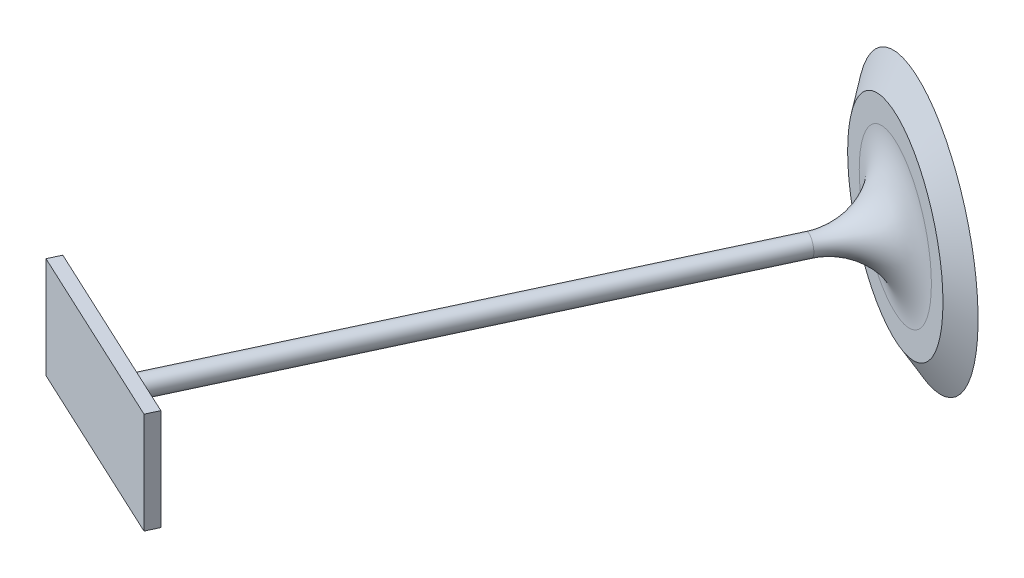
ISO-10303-21;
HEADER;
FILE_DESCRIPTION(('STEP AP214'),'2;1');
FILE_NAME('part.step','',(''),(''),'','','');
FILE_SCHEMA(('AUTOMOTIVE_DESIGN { 1 0 10303 214 1 1 1 1 }'));
ENDSEC;
DATA;
#1=APPLICATION_CONTEXT('core data for automotive mechanical design processes');
#2=APPLICATION_PROTOCOL_DEFINITION('international standard','automotive_design',2000,#1);
#3=PRODUCT_CONTEXT('',#1,'mechanical');
#4=PRODUCT('Part','Part','',(#3));
#5=PRODUCT_RELATED_PRODUCT_CATEGORY('part','',(#4));
#6=PRODUCT_DEFINITION_FORMATION('','',#4);
#7=PRODUCT_DEFINITION_CONTEXT('part definition',#1,'design');
#8=PRODUCT_DEFINITION('design','',#6,#7);
#9=PRODUCT_DEFINITION_SHAPE('','',#8);
#10=(LENGTH_UNIT() NAMED_UNIT(*) SI_UNIT(.MILLI.,.METRE.));
#11=(NAMED_UNIT(*) PLANE_ANGLE_UNIT() SI_UNIT($,.RADIAN.));
#12=(NAMED_UNIT(*) SI_UNIT($,.STERADIAN.) SOLID_ANGLE_UNIT());
#13=UNCERTAINTY_MEASURE_WITH_UNIT(LENGTH_MEASURE(1.E-05),#10,'distance_accuracy_value','');
#14=(GEOMETRIC_REPRESENTATION_CONTEXT(3) GLOBAL_UNCERTAINTY_ASSIGNED_CONTEXT((#13)) GLOBAL_UNIT_ASSIGNED_CONTEXT((#10,
#11,#12)) REPRESENTATION_CONTEXT('',''));
#15=CARTESIAN_POINT('',(0.,0.,0.));
#16=DIRECTION('',(0.,0.,1.));
#17=DIRECTION('',(1.,0.,0.));
#18=AXIS2_PLACEMENT_3D('',#15,#16,#17);
#19=CARTESIAN_POINT('',(-75.7344835628669,74.8033504536804,1.38477922887827));
#20=DIRECTION('',(-0.422618261740669,0.,0.906307787036664));
#21=DIRECTION('',(0.906307787036664,0.,0.422618261740669));
#22=AXIS2_PLACEMENT_3D('',#19,#20,#21);
#23=PLANE('',#22);
#24=DIRECTION('',(0.906307787036665,0.,0.422618261740666));
#25=VECTOR('',#24,1.);
#26=CARTESIAN_POINT('',(-88.299030378186,69.8033504536804,-4.47416517235143));
#27=LINE('',#26,#25);
#28=CARTESIAN_POINT('',(-88.299030378186,69.8033504536803,-4.47416517235143));
#29=VERTEX_POINT('',#28);
#30=CARTESIAN_POINT('',(-70.1728746374526,69.8033504536804,3.97820006246189));
#31=VERTEX_POINT('',#30);
#32=EDGE_CURVE('E80',#29,#31,#27,.T.);
#33=ORIENTED_EDGE('',*,*,#32,.T.);
#34=DIRECTION('',(0.,1.,0.));
#35=VECTOR('',#34,1.);
#36=CARTESIAN_POINT('',(-70.1728746374526,69.8033504536803,3.97820006246189));
#37=LINE('',#36,#35);
#38=CARTESIAN_POINT('',(-70.1728746374526,79.8033504536803,3.97820006246189));
#39=VERTEX_POINT('',#38);
#40=EDGE_CURVE('E79',#39,#31,#37,.F.);
#41=ORIENTED_EDGE('',*,*,#40,.F.);
#42=DIRECTION('',(-0.906307787036666,0.,-0.422618261740666));
#43=VECTOR('',#42,1.);
#44=CARTESIAN_POINT('',(-70.1728746374526,79.8033504536803,3.97820006246189));
#45=LINE('',#44,#43);
#46=CARTESIAN_POINT('',(-88.299030378186,79.8033504536803,-4.47416517235143));
#47=VERTEX_POINT('',#46);
#48=EDGE_CURVE('E66',#39,#47,#45,.T.);
#49=ORIENTED_EDGE('',*,*,#48,.T.);
#50=DIRECTION('',(0.,1.,0.));
#51=VECTOR('',#50,1.);
#52=CARTESIAN_POINT('',(-88.299030378186,79.8033504536803,-4.47416517235143));
#53=LINE('',#52,#51);
#54=EDGE_CURVE('E96',#29,#47,#53,.T.);
#55=ORIENTED_EDGE('',*,*,#54,.F.);
#56=EDGE_LOOP('',(#33,#41,#49,#55));
#57=FACE_BOUND('',#56,.T.);
#58=ADVANCED_FACE('F17',(#57),#23,.T.);
#59=CARTESIAN_POINT('',(-90.5647998457776,79.8033504536803,-5.53071082670309));
#60=DIRECTION('',(0.,-1.,0.));
#61=DIRECTION('',(0.,0.,-1.));
#62=AXIS2_PLACEMENT_3D('',#59,#60,#61);
#63=PLANE('',#62);
#64=DIRECTION('',(0.422618261740668,0.,-0.906307787036665));
#65=VECTOR('',#64,1.);
#66=CARTESIAN_POINT('',(-70.1728746374526,79.8033504536803,3.97820006246189));
#67=LINE('',#66,#65);
#68=CARTESIAN_POINT('',(-69.6446017993875,79.8033504536803,2.8453153053139));
#69=VERTEX_POINT('',#68);
#70=EDGE_CURVE('E70',#69,#39,#67,.F.);
#71=ORIENTED_EDGE('',*,*,#70,.F.);
#72=DIRECTION('',(-0.906307787036664,0.,-0.422618261740669));
#73=VECTOR('',#72,1.);
#74=CARTESIAN_POINT('',(-74.7711829870238,79.8033504536803,0.454751237365959));
#75=LINE('',#74,#73);
#76=CARTESIAN_POINT('',(-87.7707575401208,79.8033504536803,-5.60704992949947));
#77=VERTEX_POINT('',#76);
#78=EDGE_CURVE('E95',#77,#69,#75,.F.);
#79=ORIENTED_EDGE('',*,*,#78,.F.);
#80=DIRECTION('',(-0.422618261740668,0.,0.906307787036665));
#81=VECTOR('',#80,1.);
#82=CARTESIAN_POINT('',(-88.299030378186,79.8033504536803,-4.47416517235143));
#83=LINE('',#82,#81);
#84=EDGE_CURVE('E73',#47,#77,#83,.F.);
#85=ORIENTED_EDGE('',*,*,#84,.F.);
#86=ORIENTED_EDGE('',*,*,#48,.F.);
#87=EDGE_LOOP('',(#71,#79,#85,#86));
#88=FACE_BOUND('',#87,.T.);
#89=ADVANCED_FACE('F68',(#88),#63,.F.);
#90=CARTESIAN_POINT('',(-70.1728746374526,69.8033504536803,3.97820006246189));
#91=DIRECTION('',(0.906307787036665,0.,0.422618261740668));
#92=DIRECTION('',(0.422618261740668,0.,-0.906307787036665));
#93=AXIS2_PLACEMENT_3D('',#90,#91,#92);
#94=PLANE('',#93);
#95=ORIENTED_EDGE('',*,*,#40,.T.);
#96=DIRECTION('',(0.422618261740672,0.,-0.906307787036663));
#97=VECTOR('',#96,1.);
#98=CARTESIAN_POINT('',(-70.1728746374526,69.8033504536804,3.97820006246189));
#99=LINE('',#98,#97);
#100=CARTESIAN_POINT('',(-69.6446017993875,69.8033504536803,2.8453153053139));
#101=VERTEX_POINT('',#100);
#102=EDGE_CURVE('E83',#31,#101,#99,.T.);
#103=ORIENTED_EDGE('',*,*,#102,.T.);
#104=DIRECTION('',(0.,1.,0.));
#105=VECTOR('',#104,1.);
#106=CARTESIAN_POINT('',(-69.6446017993875,74.8033504536804,2.8453153053139));
#107=LINE('',#106,#105);
#108=EDGE_CURVE('E87',#69,#101,#107,.F.);
#109=ORIENTED_EDGE('',*,*,#108,.F.);
#110=ORIENTED_EDGE('',*,*,#70,.T.);
#111=EDGE_LOOP('',(#95,#103,#109,#110));
#112=FACE_BOUND('',#111,.T.);
#113=ADVANCED_FACE('F85',(#112),#94,.T.);
#114=CARTESIAN_POINT('',(-67.907105169861,69.8033504536804,5.03474571681356));
#115=DIRECTION('',(0.,1.,0.));
#116=DIRECTION('',(0.,0.,1.));
#117=AXIS2_PLACEMENT_3D('',#114,#115,#116);
#118=PLANE('',#117);
#119=DIRECTION('',(-0.422618261740668,0.,0.906307787036665));
#120=VECTOR('',#119,1.);
#121=CARTESIAN_POINT('',(-88.299030378186,69.8033504536803,-4.47416517235143));
#122=LINE('',#121,#120);
#123=CARTESIAN_POINT('',(-87.7707575401208,69.8033504536803,-5.60704992949947));
#124=VERTEX_POINT('',#123);
#125=EDGE_CURVE('E92',#124,#29,#122,.T.);
#126=ORIENTED_EDGE('',*,*,#125,.F.);
#127=DIRECTION('',(-0.906307787036664,0.,-0.422618261740669));
#128=VECTOR('',#127,1.);
#129=CARTESIAN_POINT('',(-74.7711829870238,69.8033504536803,0.454751237365957));
#130=LINE('',#129,#128);
#131=EDGE_CURVE('E104',#101,#124,#130,.T.);
#132=ORIENTED_EDGE('',*,*,#131,.F.);
#133=ORIENTED_EDGE('',*,*,#102,.F.);
#134=ORIENTED_EDGE('',*,*,#32,.F.);
#135=EDGE_LOOP('',(#126,#132,#133,#134));
#136=FACE_BOUND('',#135,.T.);
#137=ADVANCED_FACE('F191',(#136),#118,.F.);
#138=CARTESIAN_POINT('',(-88.299030378186,79.8033504536803,-4.47416517235143));
#139=DIRECTION('',(-0.906307787036665,0.,-0.422618261740668));
#140=DIRECTION('',(-0.422618261740668,0.,0.906307787036665));
#141=AXIS2_PLACEMENT_3D('',#138,#139,#140);
#142=PLANE('',#141);
#143=ORIENTED_EDGE('',*,*,#54,.T.);
#144=ORIENTED_EDGE('',*,*,#84,.T.);
#145=DIRECTION('',(0.,1.,0.));
#146=VECTOR('',#145,1.);
#147=CARTESIAN_POINT('',(-87.7707575401208,74.8033504536804,-5.60704992949947));
#148=LINE('',#147,#146);
#149=EDGE_CURVE('E100',#124,#77,#148,.T.);
#150=ORIENTED_EDGE('',*,*,#149,.F.);
#151=ORIENTED_EDGE('',*,*,#125,.T.);
#152=EDGE_LOOP('',(#143,#144,#150,#151));
#153=FACE_BOUND('',#152,.T.);
#154=ADVANCED_FACE('F193',(#153),#142,.T.);
#155=CARTESIAN_POINT('',(-47.7743519691179,74.8033504536804,-52.9317851607352));
#156=DIRECTION('',(0.422618261740669,0.,-0.906307787036664));
#157=DIRECTION('',(-0.906307787036664,0.,-0.422618261740669));
#158=AXIS2_PLACEMENT_3D('',#155,#156,#157);
#159=PLANE('',#158);
#160=CARTESIAN_POINT('',(-53.4376486277914,74.8033504536804,-55.572623763078));
#161=DIRECTION('',(0.422618261740669,0.,-0.906307787036664));
#162=DIRECTION('',(-0.906307787036664,0.,-0.422618261740669));
#163=AXIS2_PLACEMENT_3D('',#160,#161,#162);
#164=CIRCLE('',#163,12.4975129634287);
#165=CARTESIAN_POINT('',(-64.7642419451385,74.8033504536804,-60.8543009677637));
#166=VERTEX_POINT('',#165);
#167=EDGE_CURVE('E103',#166,#166,#164,.F.);
#168=ORIENTED_EDGE('',*,*,#167,.F.);
#169=EDGE_LOOP('',(#168));
#170=FACE_BOUND('',#169,.T.);
#171=ADVANCED_FACE('F186',(#170),#159,.T.);
#172=CARTESIAN_POINT('',(-74.7711829870238,74.8033504536804,0.454751237365958));
#173=DIRECTION('',(0.422618261740669,0.,-0.906307787036664));
#174=DIRECTION('',(-0.906307787036664,0.,-0.422618261740669));
#175=AXIS2_PLACEMENT_3D('',#172,#173,#174);
#176=PLANE('',#175);
#177=CARTESIAN_POINT('',(-78.7076796697542,74.8033504536804,-1.38086731209278));
#178=DIRECTION('',(0.422618261740669,0.,-0.906307787036664));
#179=DIRECTION('',(-0.906307787036664,0.,-0.422618261740669));
#180=AXIS2_PLACEMENT_3D('',#177,#178,#179);
#181=CIRCLE('',#180,0.960000000000877);
#182=CARTESIAN_POINT('',(-79.5777351453101,74.8033504536804,-1.78658084336419));
#183=VERTEX_POINT('',#182);
#184=EDGE_CURVE('E145',#183,#183,#181,.T.);
#185=ORIENTED_EDGE('',*,*,#184,.F.);
#186=EDGE_LOOP('',(#185));
#187=FACE_BOUND('',#186,.T.);
#188=ORIENTED_EDGE('',*,*,#131,.T.);
#189=ORIENTED_EDGE('',*,*,#149,.T.);
#190=ORIENTED_EDGE('',*,*,#78,.T.);
#191=ORIENTED_EDGE('',*,*,#108,.T.);
#192=EDGE_LOOP('',(#188,#189,#190,#191));
#193=FACE_BOUND('',#192,.T.);
#194=ADVANCED_FACE('F183',(#187,#193),#176,.T.);
#195=CARTESIAN_POINT('',(-53.4376486277914,74.8033504536804,-55.572623763078));
#196=DIRECTION('',(0.422618261740669,0.,-0.906307787036664));
#197=DIRECTION('',(-0.906307787036664,0.,-0.422618261740669));
#198=AXIS2_PLACEMENT_3D('',#195,#196,#197);
#199=CONICAL_SURFACE('',#198,12.4975129634287,1.04719755119197);
#200=ORIENTED_EDGE('',*,*,#167,.T.);
#201=EDGE_LOOP('',(#200));
#202=FACE_BOUND('',#201,.T.);
#203=CARTESIAN_POINT('',(-54.1138378465828,74.8033504536804,-54.1225313038059));
#204=DIRECTION('',(0.422618261740669,0.,-0.906307787036664));
#205=DIRECTION('',(-0.906307787036664,0.,-0.422618261740669));
#206=AXIS2_PLACEMENT_3D('',#203,#204,#205);
#207=CIRCLE('',#206,9.7262316713222);
#208=CARTESIAN_POINT('',(-62.9287973488247,74.8033504536804,-58.2330144260271));
#209=VERTEX_POINT('',#208);
#210=EDGE_CURVE('E143',#209,#209,#207,.F.);
#211=ORIENTED_EDGE('',*,*,#210,.F.);
#212=EDGE_LOOP('',(#211));
#213=FACE_BOUND('',#212,.T.);
#214=ADVANCED_FACE('F180',(#202,#213),#199,.T.);
#215=CARTESIAN_POINT('',(-78.7076796697542,74.8033504536804,-1.38086731209278));
#216=DIRECTION('',(0.422618261740669,0.,-0.906307787036664));
#217=DIRECTION('',(-0.906307787036664,0.,-0.422618261740669));
#218=AXIS2_PLACEMENT_3D('',#215,#216,#217);
#219=CYLINDRICAL_SURFACE('',#218,0.960000000000877);
#220=CARTESIAN_POINT('',(-56.818594721724,74.8033504536804,-48.3221614667692));
#221=DIRECTION('',(0.422618261740669,0.,-0.906307787036664));
#222=DIRECTION('',(0.,1.,0.));
#223=AXIS2_PLACEMENT_3D('',#220,#221,#222);
#224=CIRCLE('',#223,0.960000000000863);
#225=CARTESIAN_POINT('',(-56.818594721724,75.7633504536812,-48.3221614667693));
#226=VERTEX_POINT('',#225);
#227=EDGE_CURVE('E30',#226,#226,#224,.T.);
#228=ORIENTED_EDGE('',*,*,#227,.F.);
#229=EDGE_LOOP('',(#228));
#230=FACE_BOUND('',#229,.T.);
#231=ORIENTED_EDGE('',*,*,#184,.T.);
#232=EDGE_LOOP('',(#231));
#233=FACE_BOUND('',#232,.T.);
#234=ADVANCED_FACE('F125',(#230,#233),#219,.T.);
#235=CARTESIAN_POINT('',(-46.3711454391655,74.8033504536804,-50.512054539489));
#236=DIRECTION('',(-0.422618261740669,0.,0.906307787036664));
#237=DIRECTION('',(0.906307787036664,0.,0.422618261740669));
#238=AXIS2_PLACEMENT_3D('',#235,#236,#237);
#239=PLANE('',#238);
#240=CARTESIAN_POINT('',(-54.1138378465828,74.8033504536804,-54.1225313038059));
#241=DIRECTION('',(-0.422618261740669,0.,0.906307787036664));
#242=DIRECTION('',(0.,1.,0.));
#243=AXIS2_PLACEMENT_3D('',#240,#241,#242);
#244=CIRCLE('',#243,7.36000000000304);
#245=CARTESIAN_POINT('',(-54.1138378465828,82.1633504536834,-54.1225313038059));
#246=VERTEX_POINT('',#245);
#247=CARTESIAN_POINT('',(-54.1138378465828,67.4433504536773,-54.1225313038059));
#248=VERTEX_POINT('',#247);
#249=EDGE_CURVE('E11',#246,#248,#244,.T.);
#250=ORIENTED_EDGE('',*,*,#249,.F.);
#251=CARTESIAN_POINT('',(-54.1138378465828,74.8033504536804,-54.1225313038059));
#252=DIRECTION('',(-0.422618261740669,0.,0.906307787036664));
#253=DIRECTION('',(0.906307787036664,0.,0.422618261740668));
#254=AXIS2_PLACEMENT_3D('',#251,#252,#253);
#255=CIRCLE('',#254,7.36000000000305);
#256=CARTESIAN_POINT('',(-47.4434125339902,74.8033504536804,-51.0120608973933));
#257=VERTEX_POINT('',#256);
#258=EDGE_CURVE('E37',#246,#257,#255,.F.);
#259=ORIENTED_EDGE('',*,*,#258,.T.);
#260=CARTESIAN_POINT('',(-54.1138378465828,74.8033504536804,-54.1225313038059));
#261=DIRECTION('',(-0.422618261740669,0.,0.906307787036664));
#262=DIRECTION('',(0.,-1.,0.));
#263=AXIS2_PLACEMENT_3D('',#260,#261,#262);
#264=CIRCLE('',#263,7.36000000000303);
#265=EDGE_CURVE('E111',#257,#248,#264,.F.);
#266=ORIENTED_EDGE('',*,*,#265,.T.);
#267=EDGE_LOOP('',(#250,#259,#266));
#268=FACE_BOUND('',#267,.T.);
#269=ORIENTED_EDGE('',*,*,#210,.T.);
#270=EDGE_LOOP('',(#269));
#271=FACE_BOUND('',#270,.T.);
#272=ADVANCED_FACE('F116',(#268,#271),#239,.T.);
#273=CARTESIAN_POINT('',(-56.818594721724,74.8033504536804,-48.3221614667693));
#274=DIRECTION('',(0.422618261740669,0.,-0.906307787036664));
#275=DIRECTION('',(0.,1.,0.));
#276=AXIS2_PLACEMENT_3D('',#273,#274,#275);
#277=TOROIDAL_SURFACE('',#276,7.36000000000303,6.40000000000216);
#278=ORIENTED_EDGE('',*,*,#227,.T.);
#279=EDGE_LOOP('',(#278));
#280=FACE_BOUND('',#279,.T.);
#281=ORIENTED_EDGE('',*,*,#249,.T.);
#282=ORIENTED_EDGE('',*,*,#265,.F.);
#283=ORIENTED_EDGE('',*,*,#258,.F.);
#284=EDGE_LOOP('',(#281,#282,#283));
#285=FACE_BOUND('',#284,.T.);
#286=ADVANCED_FACE('F19',(#280,#285),#277,.F.);
#287=CLOSED_SHELL('',(#58,#89,#113,#137,#154,#171,#194,#214,#234,#272,#286));
#288=MANIFOLD_SOLID_BREP('B1',#287);
#289=ADVANCED_BREP_SHAPE_REPRESENTATION('',(#18,#288),#14);
#290=SHAPE_DEFINITION_REPRESENTATION(#9,#289);
ENDSEC;
END-ISO-10303-21;
